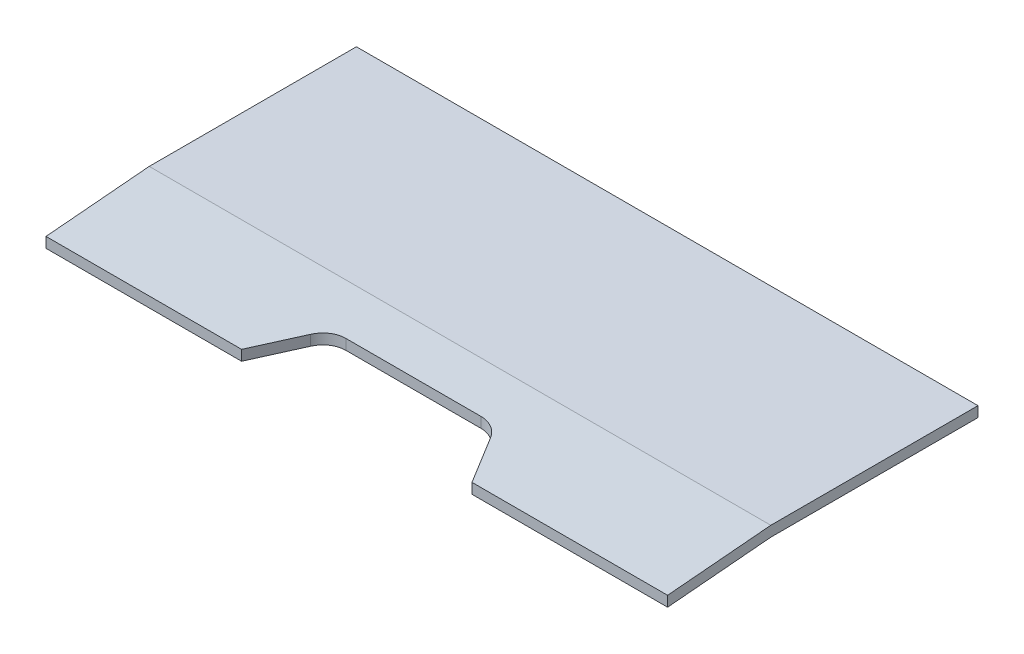
ISO-10303-21;
HEADER;
FILE_DESCRIPTION(('STEP AP214'),'2;1');
FILE_NAME('part.step','',(''),(''),'','','');
FILE_SCHEMA(('AUTOMOTIVE_DESIGN { 1 0 10303 214 1 1 1 1 }'));
ENDSEC;
DATA;
#1=APPLICATION_CONTEXT('core data for automotive mechanical design processes');
#2=APPLICATION_PROTOCOL_DEFINITION('international standard','automotive_design',2000,#1);
#3=PRODUCT_CONTEXT('',#1,'mechanical');
#4=PRODUCT('Part','Part','',(#3));
#5=PRODUCT_RELATED_PRODUCT_CATEGORY('part','',(#4));
#6=PRODUCT_DEFINITION_FORMATION('','',#4);
#7=PRODUCT_DEFINITION_CONTEXT('part definition',#1,'design');
#8=PRODUCT_DEFINITION('design','',#6,#7);
#9=PRODUCT_DEFINITION_SHAPE('','',#8);
#10=(LENGTH_UNIT() NAMED_UNIT(*) SI_UNIT(.MILLI.,.METRE.));
#11=(NAMED_UNIT(*) PLANE_ANGLE_UNIT() SI_UNIT($,.RADIAN.));
#12=(NAMED_UNIT(*) SI_UNIT($,.STERADIAN.) SOLID_ANGLE_UNIT());
#13=UNCERTAINTY_MEASURE_WITH_UNIT(LENGTH_MEASURE(1.E-05),#10,'distance_accuracy_value','');
#14=(GEOMETRIC_REPRESENTATION_CONTEXT(3) GLOBAL_UNCERTAINTY_ASSIGNED_CONTEXT((#13)) GLOBAL_UNIT_ASSIGNED_CONTEXT((#10,
#11,#12)) REPRESENTATION_CONTEXT('',''));
#15=CARTESIAN_POINT('',(0.,0.,0.));
#16=DIRECTION('',(0.,0.,1.));
#17=DIRECTION('',(1.,0.,0.));
#18=AXIS2_PLACEMENT_3D('',#15,#16,#17);
#19=CARTESIAN_POINT('',(-1200.,-17.4311485495319,599.238939618349));
#20=DIRECTION('',(0.,0.,1.));
#21=DIRECTION('',(1.,0.,0.));
#22=AXIS2_PLACEMENT_3D('',#19,#20,#21);
#23=PLANE('',#22);
#24=DIRECTION('',(0.,1.,0.));
#25=VECTOR('',#24,1.);
#26=CARTESIAN_POINT('',(-822.385668674753,-17.431148549532,599.238939618349));
#27=LINE('',#26,#25);
#28=CARTESIAN_POINT('',(-822.385668674753,-17.431148549532,599.238939618349));
#29=VERTEX_POINT('',#28);
#30=CARTESIAN_POINT('',(-822.385668674753,2.5688514504681,599.238939618349));
#31=VERTEX_POINT('',#30);
#32=EDGE_CURVE('E116',#29,#31,#27,.T.);
#33=ORIENTED_EDGE('',*,*,#32,.T.);
#34=DIRECTION('',(1.,0.,0.));
#35=VECTOR('',#34,1.);
#36=CARTESIAN_POINT('',(-1200.,2.56885145046808,599.238939618349));
#37=LINE('',#36,#35);
#38=CARTESIAN_POINT('',(-1200.,2.56885145046808,599.238939618349));
#39=VERTEX_POINT('',#38);
#40=EDGE_CURVE('E109',#39,#31,#37,.T.);
#41=ORIENTED_EDGE('',*,*,#40,.F.);
#42=DIRECTION('',(0.,-1.,0.));
#43=VECTOR('',#42,1.);
#44=CARTESIAN_POINT('',(-1200.,-17.4311485495319,599.238939618349));
#45=LINE('',#44,#43);
#46=CARTESIAN_POINT('',(-1200.,-17.4311485495319,599.238939618349));
#47=VERTEX_POINT('',#46);
#48=EDGE_CURVE('E112',#39,#47,#45,.T.);
#49=ORIENTED_EDGE('',*,*,#48,.T.);
#50=DIRECTION('',(1.,0.,0.));
#51=VECTOR('',#50,1.);
#52=CARTESIAN_POINT('',(-1200.,-17.4311485495319,599.238939618349));
#53=LINE('',#52,#51);
#54=EDGE_CURVE('E163',#47,#29,#53,.T.);
#55=ORIENTED_EDGE('',*,*,#54,.T.);
#56=EDGE_LOOP('',(#33,#41,#49,#55));
#57=FACE_BOUND('',#56,.T.);
#58=ADVANCED_FACE('F38',(#57),#23,.T.);
#59=CARTESIAN_POINT('',(-1200.,0.,0.));
#60=DIRECTION('',(0.,-1.,0.));
#61=DIRECTION('',(0.,0.,-1.));
#62=AXIS2_PLACEMENT_3D('',#59,#60,#61);
#63=PLANE('',#62);
#64=DIRECTION('',(0.,0.,-1.));
#65=VECTOR('',#64,1.);
#66=CARTESIAN_POINT('',(0.,0.,0.));
#67=LINE('',#66,#65);
#68=CARTESIAN_POINT('',(0.,0.,400.));
#69=VERTEX_POINT('',#68);
#70=CARTESIAN_POINT('',(0.,0.,0.));
#71=VERTEX_POINT('',#70);
#72=EDGE_CURVE('E141',#69,#71,#67,.T.);
#73=ORIENTED_EDGE('',*,*,#72,.F.);
#74=DIRECTION('',(1.,0.,0.));
#75=VECTOR('',#74,1.);
#76=CARTESIAN_POINT('',(-1200.,0.,400.));
#77=LINE('',#76,#75);
#78=CARTESIAN_POINT('',(-1200.,0.,400.));
#79=VERTEX_POINT('',#78);
#80=EDGE_CURVE('E62',#79,#69,#77,.T.);
#81=ORIENTED_EDGE('',*,*,#80,.F.);
#82=DIRECTION('',(0.,0.,-1.));
#83=VECTOR('',#82,1.);
#84=CARTESIAN_POINT('',(-1200.,0.,0.));
#85=LINE('',#84,#83);
#86=CARTESIAN_POINT('',(-1200.,0.,0.));
#87=VERTEX_POINT('',#86);
#88=EDGE_CURVE('E160',#79,#87,#85,.T.);
#89=ORIENTED_EDGE('',*,*,#88,.T.);
#90=DIRECTION('',(1.,0.,0.));
#91=VECTOR('',#90,1.);
#92=CARTESIAN_POINT('',(-1200.,0.,0.));
#93=LINE('',#92,#91);
#94=EDGE_CURVE('E95',#87,#71,#93,.T.);
#95=ORIENTED_EDGE('',*,*,#94,.T.);
#96=EDGE_LOOP('',(#73,#81,#89,#95));
#97=FACE_BOUND('',#96,.T.);
#98=ADVANCED_FACE('F40',(#97),#63,.T.);
#99=CARTESIAN_POINT('',(-1200.,0.,400.));
#100=DIRECTION('',(0.,-0.996194698091745,-0.0871557427476591));
#101=DIRECTION('',(0.,0.0871557427476591,-0.996194698091745));
#102=AXIS2_PLACEMENT_3D('',#99,#100,#101);
#103=PLANE('',#102);
#104=DIRECTION('',(0.499386864121775,0.0755099147173294,-0.863082274596114));
#105=VECTOR('',#104,1.);
#106=CARTESIAN_POINT('',(-830.026195326043,-18.5864362779124,612.443938778477));
#107=LINE('',#106,#105);
#108=CARTESIAN_POINT('',(-773.548859855105,-10.0467667526192,514.835069456079));
#109=VERTEX_POINT('',#108);
#110=EDGE_CURVE('E145',#29,#109,#107,.T.);
#111=ORIENTED_EDGE('',*,*,#110,.F.);
#112=ORIENTED_EDGE('',*,*,#54,.F.);
#113=DIRECTION('',(0.,0.0871557427476591,-0.996194698091745));
#114=VECTOR('',#113,1.);
#115=CARTESIAN_POINT('',(-1200.,0.,400.));
#116=LINE('',#115,#114);
#117=EDGE_CURVE('E129',#47,#79,#116,.T.);
#118=ORIENTED_EDGE('',*,*,#117,.T.);
#119=ORIENTED_EDGE('',*,*,#80,.T.);
#120=DIRECTION('',(0.,0.0871557427476591,-0.996194698091745));
#121=VECTOR('',#120,1.);
#122=CARTESIAN_POINT('',(0.,0.,400.));
#123=LINE('',#122,#121);
#124=CARTESIAN_POINT('',(0.,-17.4311485495319,599.238939618349));
#125=VERTEX_POINT('',#124);
#126=EDGE_CURVE('E157',#125,#69,#123,.T.);
#127=ORIENTED_EDGE('',*,*,#126,.F.);
#128=CARTESIAN_POINT('',(-377.614331325246,-17.431148549532,599.238939618349));
#129=VERTEX_POINT('',#128);
#130=EDGE_CURVE('E120',#129,#125,#53,.T.);
#131=ORIENTED_EDGE('',*,*,#130,.F.);
#132=DIRECTION('',(0.499386864121775,-0.0755099147173293,0.863082274596114));
#133=VECTOR('',#132,1.);
#134=CARTESIAN_POINT('',(-669.238492742814,26.6639551470353,95.2295980709064));
#135=LINE('',#134,#133);
#136=CARTESIAN_POINT('',(-426.451140144895,-10.0467667526192,514.835069456079));
#137=VERTEX_POINT('',#136);
#138=EDGE_CURVE('E194',#137,#129,#135,.T.);
#139=ORIENTED_EDGE('',*,*,#138,.F.);
#140=CARTESIAN_POINT('',(-469.728809412308,-12.237555809818,539.875902964178));
#141=DIRECTION('',(0.,-0.996194698091745,-0.0871557427476591));
#142=DIRECTION('',(0.,0.0871557427476591,-0.996194698091745));
#143=AXIS2_PLACEMENT_3D('',#140,#141,#142);
#144=ELLIPSE('',#143,50.1909918771673,49.9999999999999);
#145=CARTESIAN_POINT('',(-469.728809412309,-7.86312263352173,489.875902964178));
#146=VERTEX_POINT('',#145);
#147=EDGE_CURVE('E196',#146,#137,#144,.T.);
#148=ORIENTED_EDGE('',*,*,#147,.F.);
#149=DIRECTION('',(1.,0.,0.));
#150=VECTOR('',#149,1.);
#151=CARTESIAN_POINT('',(-1200.,-7.86312263352181,489.875902964179));
#152=LINE('',#151,#150);
#153=CARTESIAN_POINT('',(-730.271190587691,-7.86312263352175,489.875902964178));
#154=VERTEX_POINT('',#153);
#155=EDGE_CURVE('E210',#154,#146,#152,.T.);
#156=ORIENTED_EDGE('',*,*,#155,.F.);
#157=CARTESIAN_POINT('',(-730.271190587692,-12.237555809818,539.875902964178));
#158=DIRECTION('',(0.,-0.996194698091745,-0.0871557427476591));
#159=DIRECTION('',(0.,0.0871557427476591,-0.996194698091745));
#160=AXIS2_PLACEMENT_3D('',#157,#158,#159);
#161=ELLIPSE('',#160,50.1909918771674,50.);
#162=EDGE_CURVE('E213',#109,#154,#161,.T.);
#163=ORIENTED_EDGE('',*,*,#162,.F.);
#164=EDGE_LOOP('',(#111,#112,#118,#119,#127,#131,#139,#148,#156,#163));
#165=FACE_BOUND('',#164,.T.);
#166=ADVANCED_FACE('F222',(#165),#103,.T.);
#167=DIRECTION('',(0.,1.,0.));
#168=VECTOR('',#167,1.);
#169=CARTESIAN_POINT('',(-377.614331325246,-17.431148549532,599.238939618349));
#170=LINE('',#169,#168);
#171=CARTESIAN_POINT('',(-377.614331325247,2.56885145046808,599.238939618349));
#172=VERTEX_POINT('',#171);
#173=EDGE_CURVE('E53',#129,#172,#170,.T.);
#174=ORIENTED_EDGE('',*,*,#173,.F.);
#175=ORIENTED_EDGE('',*,*,#130,.T.);
#176=DIRECTION('',(0.,-1.,0.));
#177=VECTOR('',#176,1.);
#178=CARTESIAN_POINT('',(0.,-17.4311485495319,599.238939618349));
#179=LINE('',#178,#177);
#180=CARTESIAN_POINT('',(0.,2.56885145046808,599.238939618349));
#181=VERTEX_POINT('',#180);
#182=EDGE_CURVE('E154',#181,#125,#179,.T.);
#183=ORIENTED_EDGE('',*,*,#182,.F.);
#184=EDGE_CURVE('E121',#172,#181,#37,.T.);
#185=ORIENTED_EDGE('',*,*,#184,.F.);
#186=EDGE_LOOP('',(#174,#175,#183,#185));
#187=FACE_BOUND('',#186,.T.);
#188=ADVANCED_FACE('F230',(#187),#23,.T.);
#189=CARTESIAN_POINT('',(-1200.,2.56885145046808,599.238939618349));
#190=DIRECTION('',(0.,0.996194698091746,0.087155742747659));
#191=DIRECTION('',(0.,-0.087155742747659,0.996194698091746));
#192=AXIS2_PLACEMENT_3D('',#189,#190,#191);
#193=PLANE('',#192);
#194=DIRECTION('',(-0.499386864121775,-0.0755099147173292,0.863082274596114));
#195=VECTOR('',#194,1.);
#196=CARTESIAN_POINT('',(-916.55786457007,-11.6704787996463,761.995229133447));
#197=LINE('',#196,#195);
#198=CARTESIAN_POINT('',(-773.548859855105,9.95323324738077,514.835069456079));
#199=VERTEX_POINT('',#198);
#200=EDGE_CURVE('E11',#199,#31,#197,.T.);
#201=ORIENTED_EDGE('',*,*,#200,.F.);
#202=CARTESIAN_POINT('',(-730.271190587692,7.76244419018197,539.875902964178));
#203=DIRECTION('',(0.,0.996194698091746,0.087155742747659));
#204=DIRECTION('',(0.,0.087155742747659,-0.996194698091746));
#205=AXIS2_PLACEMENT_3D('',#202,#203,#204);
#206=ELLIPSE('',#205,50.1909918771674,50.);
#207=CARTESIAN_POINT('',(-730.271190587691,12.1368773664782,489.875902964178));
#208=VERTEX_POINT('',#207);
#209=EDGE_CURVE('E46',#208,#199,#206,.T.);
#210=ORIENTED_EDGE('',*,*,#209,.F.);
#211=DIRECTION('',(-1.,0.,0.));
#212=VECTOR('',#211,1.);
#213=CARTESIAN_POINT('',(-1200.,12.1368773664782,489.875902964179));
#214=LINE('',#213,#212);
#215=CARTESIAN_POINT('',(-469.728809412309,12.1368773664782,489.875902964178));
#216=VERTEX_POINT('',#215);
#217=EDGE_CURVE('E173',#216,#208,#214,.T.);
#218=ORIENTED_EDGE('',*,*,#217,.F.);
#219=CARTESIAN_POINT('',(-469.728809412308,7.76244419018201,539.875902964178));
#220=DIRECTION('',(0.,0.996194698091746,0.087155742747659));
#221=DIRECTION('',(0.,0.087155742747659,-0.996194698091746));
#222=AXIS2_PLACEMENT_3D('',#219,#220,#221);
#223=ELLIPSE('',#222,50.1909918771673,49.9999999999999);
#224=CARTESIAN_POINT('',(-426.451140144895,9.95323324738079,514.835069456079));
#225=VERTEX_POINT('',#224);
#226=EDGE_CURVE('E170',#225,#216,#223,.T.);
#227=ORIENTED_EDGE('',*,*,#226,.F.);
#228=DIRECTION('',(-0.499386864121776,0.0755099147173292,-0.863082274596114));
#229=VECTOR('',#228,1.);
#230=CARTESIAN_POINT('',(-582.706823498787,33.5799126253014,244.780888425876));
#231=LINE('',#230,#229);
#232=EDGE_CURVE('E162',#172,#225,#231,.T.);
#233=ORIENTED_EDGE('',*,*,#232,.F.);
#234=ORIENTED_EDGE('',*,*,#184,.T.);
#235=DIRECTION('',(0.,-0.087155742747659,0.996194698091746));
#236=VECTOR('',#235,1.);
#237=CARTESIAN_POINT('',(0.,2.56885145046808,599.238939618349));
#238=LINE('',#237,#236);
#239=CARTESIAN_POINT('',(0.,19.9999999999999,400.));
#240=VERTEX_POINT('',#239);
#241=EDGE_CURVE('E151',#240,#181,#238,.T.);
#242=ORIENTED_EDGE('',*,*,#241,.F.);
#243=DIRECTION('',(1.,0.,0.));
#244=VECTOR('',#243,1.);
#245=CARTESIAN_POINT('',(-1200.,19.9999999999999,400.));
#246=LINE('',#245,#244);
#247=CARTESIAN_POINT('',(-1200.,19.9999999999999,400.));
#248=VERTEX_POINT('',#247);
#249=EDGE_CURVE('E133',#248,#240,#246,.T.);
#250=ORIENTED_EDGE('',*,*,#249,.F.);
#251=DIRECTION('',(0.,-0.087155742747659,0.996194698091746));
#252=VECTOR('',#251,1.);
#253=CARTESIAN_POINT('',(-1200.,2.56885145046808,599.238939618349));
#254=LINE('',#253,#252);
#255=EDGE_CURVE('E127',#248,#39,#254,.T.);
#256=ORIENTED_EDGE('',*,*,#255,.T.);
#257=ORIENTED_EDGE('',*,*,#40,.T.);
#258=EDGE_LOOP('',(#201,#210,#218,#227,#233,#234,#242,#250,#256,#257));
#259=FACE_BOUND('',#258,.T.);
#260=ADVANCED_FACE('F131',(#259),#193,.T.);
#261=CARTESIAN_POINT('',(-1200.,19.9999999999999,400.));
#262=DIRECTION('',(0.,1.,0.));
#263=DIRECTION('',(0.,0.,1.));
#264=AXIS2_PLACEMENT_3D('',#261,#262,#263);
#265=PLANE('',#264);
#266=DIRECTION('',(0.,0.,1.));
#267=VECTOR('',#266,1.);
#268=CARTESIAN_POINT('',(0.,19.9999999999999,400.));
#269=LINE('',#268,#267);
#270=CARTESIAN_POINT('',(0.,19.9999999999999,0.));
#271=VERTEX_POINT('',#270);
#272=EDGE_CURVE('E148',#271,#240,#269,.T.);
#273=ORIENTED_EDGE('',*,*,#272,.F.);
#274=DIRECTION('',(1.,0.,0.));
#275=VECTOR('',#274,1.);
#276=CARTESIAN_POINT('',(-1200.,19.9999999999999,0.));
#277=LINE('',#276,#275);
#278=CARTESIAN_POINT('',(-1200.,19.9999999999999,0.));
#279=VERTEX_POINT('',#278);
#280=EDGE_CURVE('E166',#279,#271,#277,.T.);
#281=ORIENTED_EDGE('',*,*,#280,.F.);
#282=DIRECTION('',(0.,0.,1.));
#283=VECTOR('',#282,1.);
#284=CARTESIAN_POINT('',(-1200.,19.9999999999999,400.));
#285=LINE('',#284,#283);
#286=EDGE_CURVE('E134',#279,#248,#285,.T.);
#287=ORIENTED_EDGE('',*,*,#286,.T.);
#288=ORIENTED_EDGE('',*,*,#249,.T.);
#289=EDGE_LOOP('',(#273,#281,#287,#288));
#290=FACE_BOUND('',#289,.T.);
#291=ADVANCED_FACE('F272',(#290),#265,.T.);
#292=CARTESIAN_POINT('',(-1200.,19.9999999999999,0.));
#293=DIRECTION('',(0.,0.,-1.));
#294=DIRECTION('',(0.,1.,0.));
#295=AXIS2_PLACEMENT_3D('',#292,#293,#294);
#296=PLANE('',#295);
#297=DIRECTION('',(0.,1.,0.));
#298=VECTOR('',#297,1.);
#299=CARTESIAN_POINT('',(0.,19.9999999999999,0.));
#300=LINE('',#299,#298);
#301=EDGE_CURVE('E144',#71,#271,#300,.T.);
#302=ORIENTED_EDGE('',*,*,#301,.F.);
#303=ORIENTED_EDGE('',*,*,#94,.F.);
#304=DIRECTION('',(0.,1.,0.));
#305=VECTOR('',#304,1.);
#306=CARTESIAN_POINT('',(-1200.,19.9999999999999,0.));
#307=LINE('',#306,#305);
#308=EDGE_CURVE('E136',#87,#279,#307,.T.);
#309=ORIENTED_EDGE('',*,*,#308,.T.);
#310=ORIENTED_EDGE('',*,*,#280,.T.);
#311=EDGE_LOOP('',(#302,#303,#309,#310));
#312=FACE_BOUND('',#311,.T.);
#313=ADVANCED_FACE('F216',(#312),#296,.T.);
#314=CARTESIAN_POINT('',(-1200.,0.,0.));
#315=DIRECTION('',(-1.,0.,0.));
#316=DIRECTION('',(0.,0.,1.));
#317=AXIS2_PLACEMENT_3D('',#314,#315,#316);
#318=PLANE('',#317);
#319=ORIENTED_EDGE('',*,*,#88,.F.);
#320=ORIENTED_EDGE('',*,*,#117,.F.);
#321=ORIENTED_EDGE('',*,*,#48,.F.);
#322=ORIENTED_EDGE('',*,*,#255,.F.);
#323=ORIENTED_EDGE('',*,*,#286,.F.);
#324=ORIENTED_EDGE('',*,*,#308,.F.);
#325=EDGE_LOOP('',(#319,#320,#321,#322,#323,#324));
#326=FACE_BOUND('',#325,.T.);
#327=ADVANCED_FACE('F125',(#326),#318,.T.);
#328=CARTESIAN_POINT('',(0.,0.,0.));
#329=DIRECTION('',(-1.,0.,0.));
#330=DIRECTION('',(0.,0.,1.));
#331=AXIS2_PLACEMENT_3D('',#328,#329,#330);
#332=PLANE('',#331);
#333=ORIENTED_EDGE('',*,*,#72,.T.);
#334=ORIENTED_EDGE('',*,*,#301,.T.);
#335=ORIENTED_EDGE('',*,*,#272,.T.);
#336=ORIENTED_EDGE('',*,*,#241,.T.);
#337=ORIENTED_EDGE('',*,*,#182,.T.);
#338=ORIENTED_EDGE('',*,*,#126,.T.);
#339=EDGE_LOOP('',(#333,#334,#335,#336,#337,#338));
#340=FACE_BOUND('',#339,.T.);
#341=ADVANCED_FACE('F219',(#340),#332,.F.);
#342=CARTESIAN_POINT('',(-822.385668674753,-17.431148549532,599.238939618349));
#343=DIRECTION('',(-0.865553385348274,0.,-0.500816670161989));
#344=DIRECTION('',(-0.500816670161989,0.,0.865553385348274));
#345=AXIS2_PLACEMENT_3D('',#342,#343,#344);
#346=PLANE('',#345);
#347=ORIENTED_EDGE('',*,*,#110,.T.);
#348=DIRECTION('',(0.,1.,0.));
#349=VECTOR('',#348,1.);
#350=CARTESIAN_POINT('',(-773.548859855105,-17.431148549532,514.835069456079));
#351=LINE('',#350,#349);
#352=EDGE_CURVE('E184',#109,#199,#351,.T.);
#353=ORIENTED_EDGE('',*,*,#352,.T.);
#354=ORIENTED_EDGE('',*,*,#200,.T.);
#355=ORIENTED_EDGE('',*,*,#32,.F.);
#356=EDGE_LOOP('',(#347,#353,#354,#355));
#357=FACE_BOUND('',#356,.T.);
#358=ADVANCED_FACE('F192',(#357),#346,.F.);
#359=CARTESIAN_POINT('',(-730.271190587692,-17.431148549532,539.875902964178));
#360=DIRECTION('',(0.,1.,0.));
#361=DIRECTION('',(0.,0.,1.));
#362=AXIS2_PLACEMENT_3D('',#359,#360,#361);
#363=CYLINDRICAL_SURFACE('',#362,50.);
#364=ORIENTED_EDGE('',*,*,#162,.T.);
#365=DIRECTION('',(0.,1.,0.));
#366=VECTOR('',#365,1.);
#367=CARTESIAN_POINT('',(-730.271190587691,-17.431148549532,489.875902964178));
#368=LINE('',#367,#366);
#369=EDGE_CURVE('E188',#154,#208,#368,.T.);
#370=ORIENTED_EDGE('',*,*,#369,.T.);
#371=ORIENTED_EDGE('',*,*,#209,.T.);
#372=ORIENTED_EDGE('',*,*,#352,.F.);
#373=EDGE_LOOP('',(#364,#370,#371,#372));
#374=FACE_BOUND('',#373,.T.);
#375=ADVANCED_FACE('F182',(#374),#363,.F.);
#376=CARTESIAN_POINT('',(-730.271190587691,-17.431148549532,489.875902964178));
#377=DIRECTION('',(0.,0.,-1.));
#378=DIRECTION('',(-1.,0.,0.));
#379=AXIS2_PLACEMENT_3D('',#376,#377,#378);
#380=PLANE('',#379);
#381=ORIENTED_EDGE('',*,*,#155,.T.);
#382=DIRECTION('',(0.,1.,0.));
#383=VECTOR('',#382,1.);
#384=CARTESIAN_POINT('',(-469.728809412309,-17.431148549532,489.875902964178));
#385=LINE('',#384,#383);
#386=EDGE_CURVE('E198',#146,#216,#385,.T.);
#387=ORIENTED_EDGE('',*,*,#386,.T.);
#388=ORIENTED_EDGE('',*,*,#217,.T.);
#389=ORIENTED_EDGE('',*,*,#369,.F.);
#390=EDGE_LOOP('',(#381,#387,#388,#389));
#391=FACE_BOUND('',#390,.T.);
#392=ADVANCED_FACE('F250',(#391),#380,.F.);
#393=CARTESIAN_POINT('',(-469.728809412308,-17.431148549532,539.875902964178));
#394=DIRECTION('',(0.,1.,0.));
#395=DIRECTION('',(0.,0.,1.));
#396=AXIS2_PLACEMENT_3D('',#393,#394,#395);
#397=CYLINDRICAL_SURFACE('',#396,49.9999999999999);
#398=ORIENTED_EDGE('',*,*,#147,.T.);
#399=DIRECTION('',(0.,1.,0.));
#400=VECTOR('',#399,1.);
#401=CARTESIAN_POINT('',(-426.451140144895,-17.431148549532,514.835069456079));
#402=LINE('',#401,#400);
#403=EDGE_CURVE('E203',#137,#225,#402,.T.);
#404=ORIENTED_EDGE('',*,*,#403,.T.);
#405=ORIENTED_EDGE('',*,*,#226,.T.);
#406=ORIENTED_EDGE('',*,*,#386,.F.);
#407=EDGE_LOOP('',(#398,#404,#405,#406));
#408=FACE_BOUND('',#407,.T.);
#409=ADVANCED_FACE('F239',(#408),#397,.F.);
#410=CARTESIAN_POINT('',(-377.614331325246,-17.431148549532,599.238939618349));
#411=DIRECTION('',(0.865553385348274,0.,-0.500816670161989));
#412=DIRECTION('',(-0.500816670161989,0.,-0.865553385348274));
#413=AXIS2_PLACEMENT_3D('',#410,#411,#412);
#414=PLANE('',#413);
#415=ORIENTED_EDGE('',*,*,#138,.T.);
#416=ORIENTED_EDGE('',*,*,#173,.T.);
#417=ORIENTED_EDGE('',*,*,#232,.T.);
#418=ORIENTED_EDGE('',*,*,#403,.F.);
#419=EDGE_LOOP('',(#415,#416,#417,#418));
#420=FACE_BOUND('',#419,.T.);
#421=ADVANCED_FACE('F235',(#420),#414,.F.);
#422=CLOSED_SHELL('',(#58,#98,#166,#188,#260,#291,#313,#327,#341,#358,#375,#392,#409,#421));
#423=MANIFOLD_SOLID_BREP('B2',#422);
#424=ADVANCED_BREP_SHAPE_REPRESENTATION('',(#18,#423),#14);
#425=SHAPE_DEFINITION_REPRESENTATION(#9,#424);
ENDSEC;
END-ISO-10303-21;
